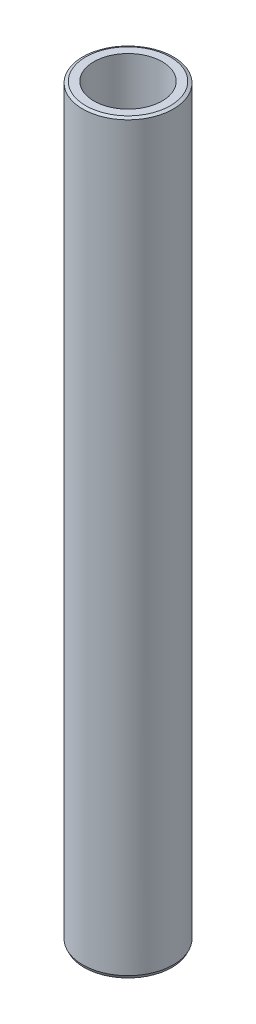
ISO-10303-21;
HEADER;
FILE_DESCRIPTION(('STEP AP214'),'2;1');
FILE_NAME('part.step','',(''),(''),'','','');
FILE_SCHEMA(('AUTOMOTIVE_DESIGN { 1 0 10303 214 1 1 1 1 }'));
ENDSEC;
DATA;
#1=APPLICATION_CONTEXT('core data for automotive mechanical design processes');
#2=APPLICATION_PROTOCOL_DEFINITION('international standard','automotive_design',2000,#1);
#3=PRODUCT_CONTEXT('',#1,'mechanical');
#4=PRODUCT('Part','Part','',(#3));
#5=PRODUCT_RELATED_PRODUCT_CATEGORY('part','',(#4));
#6=PRODUCT_DEFINITION_FORMATION('','',#4);
#7=PRODUCT_DEFINITION_CONTEXT('part definition',#1,'design');
#8=PRODUCT_DEFINITION('design','',#6,#7);
#9=PRODUCT_DEFINITION_SHAPE('','',#8);
#10=(LENGTH_UNIT() NAMED_UNIT(*) SI_UNIT(.MILLI.,.METRE.));
#11=(NAMED_UNIT(*) PLANE_ANGLE_UNIT() SI_UNIT($,.RADIAN.));
#12=(NAMED_UNIT(*) SI_UNIT($,.STERADIAN.) SOLID_ANGLE_UNIT());
#13=UNCERTAINTY_MEASURE_WITH_UNIT(LENGTH_MEASURE(1.E-05),#10,'distance_accuracy_value','');
#14=(GEOMETRIC_REPRESENTATION_CONTEXT(3) GLOBAL_UNCERTAINTY_ASSIGNED_CONTEXT((#13)) GLOBAL_UNIT_ASSIGNED_CONTEXT((#10,
#11,#12)) REPRESENTATION_CONTEXT('',''));
#15=CARTESIAN_POINT('',(0.,0.,0.));
#16=DIRECTION('',(0.,0.,1.));
#17=DIRECTION('',(1.,0.,0.));
#18=AXIS2_PLACEMENT_3D('',#15,#16,#17);
#19=CARTESIAN_POINT('',(0.,247.086293420265,0.));
#20=DIRECTION('',(0.,-1.,0.));
#21=DIRECTION('',(0.,0.,-1.));
#22=AXIS2_PLACEMENT_3D('',#19,#20,#21);
#23=CYLINDRICAL_SURFACE('',#22,15.);
#24=CARTESIAN_POINT('',(0.,246.631129493931,0.));
#25=DIRECTION('',(0.,1.,0.));
#26=DIRECTION('',(0.,0.,1.));
#27=AXIS2_PLACEMENT_3D('',#24,#25,#26);
#28=CIRCLE('',#27,15.);
#29=CARTESIAN_POINT('',(0.,246.631129493931,-15.));
#30=VERTEX_POINT('',#29);
#31=EDGE_CURVE('E50',#30,#30,#28,.F.);
#32=CARTESIAN_POINT('',(0.,0.98682713540299,0.));
#33=DIRECTION('',(0.,1.,0.));
#34=DIRECTION('',(0.,0.,1.));
#35=AXIS2_PLACEMENT_3D('',#32,#33,#34);
#36=CIRCLE('',#35,15.);
#37=CARTESIAN_POINT('',(0.,0.986827135402962,-15.));
#38=VERTEX_POINT('',#37);
#39=EDGE_CURVE('E51',#38,#38,#36,.T.);
#40=CARTESIAN_POINT('',(0.,246.631129493931,-15.));
#41=CARTESIAN_POINT('',(0.,244.072334677696,-15.));
#42=CARTESIAN_POINT('',(0.,241.513539861461,-15.));
#43=CARTESIAN_POINT('',(0.,236.395950228992,-15.));
#44=CARTESIAN_POINT('',(0.,233.837155412757,-15.));
#45=CARTESIAN_POINT('',(0.,228.719565780288,-15.));
#46=CARTESIAN_POINT('',(0.,226.160770964053,-15.));
#47=CARTESIAN_POINT('',(0.,221.043181331584,-15.));
#48=CARTESIAN_POINT('',(0.,218.484386515349,-15.));
#49=CARTESIAN_POINT('',(0.,213.36679688288,-15.));
#50=CARTESIAN_POINT('',(0.,210.808002066645,-15.));
#51=CARTESIAN_POINT('',(0.,205.690412434176,-15.));
#52=CARTESIAN_POINT('',(0.,203.131617617941,-15.));
#53=CARTESIAN_POINT('',(0.,198.014027985472,-15.));
#54=CARTESIAN_POINT('',(0.,195.455233169237,-15.));
#55=CARTESIAN_POINT('',(0.,190.337643536768,-15.));
#56=CARTESIAN_POINT('',(0.,187.778848720533,-15.));
#57=CARTESIAN_POINT('',(0.,182.661259088064,-15.));
#58=CARTESIAN_POINT('',(0.,180.102464271829,-15.));
#59=CARTESIAN_POINT('',(0.,174.98487463936,-15.));
#60=CARTESIAN_POINT('',(0.,172.426079823125,-15.));
#61=CARTESIAN_POINT('',(0.,167.308490190656,-15.));
#62=CARTESIAN_POINT('',(0.,164.749695374421,-15.));
#63=CARTESIAN_POINT('',(0.,159.632105741952,-15.));
#64=CARTESIAN_POINT('',(0.,157.073310925717,-15.));
#65=CARTESIAN_POINT('',(0.,151.955721293248,-15.));
#66=CARTESIAN_POINT('',(0.,149.396926477013,-15.));
#67=CARTESIAN_POINT('',(0.,144.279336844544,-15.));
#68=CARTESIAN_POINT('',(0.,141.720542028309,-15.));
#69=CARTESIAN_POINT('',(0.,136.60295239584,-15.));
#70=CARTESIAN_POINT('',(0.,134.044157579605,-15.));
#71=CARTESIAN_POINT('',(0.,128.926567947136,-15.));
#72=CARTESIAN_POINT('',(0.,126.367773130901,-15.));
#73=CARTESIAN_POINT('',(0.,121.250183498432,-15.));
#74=CARTESIAN_POINT('',(0.,118.691388682197,-15.));
#75=CARTESIAN_POINT('',(0.,113.573799049728,-15.));
#76=CARTESIAN_POINT('',(0.,111.015004233493,-15.));
#77=CARTESIAN_POINT('',(0.,105.897414601024,-15.));
#78=CARTESIAN_POINT('',(0.,103.33861978479,-15.));
#79=CARTESIAN_POINT('',(0.,98.2210301523202,-15.));
#80=CARTESIAN_POINT('',(0.,95.6622353360856,-15.));
#81=CARTESIAN_POINT('',(0.,90.5446457036162,-15.));
#82=CARTESIAN_POINT('',(0.,87.9858508873816,-15.));
#83=CARTESIAN_POINT('',(0.,82.8682612549122,-15.));
#84=CARTESIAN_POINT('',(0.,80.3094664386776,-15.));
#85=CARTESIAN_POINT('',(0.,75.1918768062082,-15.));
#86=CARTESIAN_POINT('',(0.,72.6330819899736,-15.));
#87=CARTESIAN_POINT('',(0.,67.5154923575042,-15.));
#88=CARTESIAN_POINT('',(0.,64.9566975412696,-15.));
#89=CARTESIAN_POINT('',(0.,59.8391079088002,-15.));
#90=CARTESIAN_POINT('',(0.,57.2803130925656,-15.));
#91=CARTESIAN_POINT('',(0.,52.1627234600962,-15.));
#92=CARTESIAN_POINT('',(0.,49.6039286438616,-15.));
#93=CARTESIAN_POINT('',(0.,44.4863390113923,-15.));
#94=CARTESIAN_POINT('',(0.,41.9275441951576,-15.));
#95=CARTESIAN_POINT('',(0.,36.8099545626883,-15.));
#96=CARTESIAN_POINT('',(0.,34.2511597464536,-15.));
#97=CARTESIAN_POINT('',(0.,29.1335701139843,-15.));
#98=CARTESIAN_POINT('',(0.,26.5747752977496,-15.));
#99=CARTESIAN_POINT('',(0.,21.4571856652803,-15.));
#100=CARTESIAN_POINT('',(0.,18.8983908490456,-15.));
#101=CARTESIAN_POINT('',(0.,13.7808012165763,-15.));
#102=CARTESIAN_POINT('',(0.,11.2220064003416,-15.));
#103=CARTESIAN_POINT('',(0.,6.1044167678723,-15.));
#104=CARTESIAN_POINT('',(0.,3.54562195163763,-15.));
#105=CARTESIAN_POINT('',(0.,0.986827135402962,-15.));
#106=B_SPLINE_CURVE_WITH_KNOTS('',3,(#40,#41,#42,#43,#44,#45,#46,#47,#48,#49,#50,#51,#52,#53,
#54,#55,#56,#57,#58,#59,#60,#61,#62,#63,#64,#65,#66,#67,#68,#69,#70,#71,#72,#73,#74,#75,#76,#77,
#78,#79,#80,#81,#82,#83,#84,#85,#86,#87,#88,#89,#90,#91,#92,#93,#94,#95,#96,#97,#98,#99,#100,
#101,#102,#103,#104,#105),.UNSPECIFIED.,.F.,.F.,(4,2,2,2,2,2,2,2,2,2,2,2,2,2,2,2,2,2,2,2,2,2,2,
2,2,2,2,2,2,2,2,2,4),(0.,7.676384448704,15.352768897408,23.029153346112,30.705537794816,
38.38192224352,46.058306692224,53.734691140928,61.4110755896319,69.0874600383359,
76.7638444870399,84.4402289357439,92.1166133844479,99.7929978331519,107.469382281856,
115.14576673056,122.822151179264,130.498535627968,138.174920076672,145.851304525376,
153.52768897408,161.204073422784,168.880457871488,176.556842320192,184.233226768896,
191.9096112176,199.585995666304,207.262380115008,214.938764563712,222.615149012416,
230.29153346112,237.967917909824,245.644302358528),.UNSPECIFIED.);
#107=EDGE_CURVE('BSEAM39',#30,#38,#106,.T.);
#108=ORIENTED_EDGE('',*,*,#31,.T.);
#109=ORIENTED_EDGE('',*,*,#39,.T.);
#110=ORIENTED_EDGE('',*,*,#107,.T.);
#111=ORIENTED_EDGE('',*,*,#107,.F.);
#112=EDGE_LOOP('',(#108,#110,#109,#111));
#113=FACE_BOUND('',#112,.T.);
#114=ADVANCED_FACE('F39',(#113),#23,.T.);
#115=CARTESIAN_POINT('',(0.,247.086293420265,0.));
#116=DIRECTION('',(0.,1.,0.));
#117=DIRECTION('',(0.,0.,1.));
#118=AXIS2_PLACEMENT_3D('',#115,#116,#117);
#119=PLANE('',#118);
#120=CARTESIAN_POINT('',(0.,247.086293420265,0.));
#121=DIRECTION('',(0.,1.,0.));
#122=DIRECTION('',(0.,0.,1.));
#123=AXIS2_PLACEMENT_3D('',#120,#121,#122);
#124=CIRCLE('',#123,14.0131728645976);
#125=CARTESIAN_POINT('',(0.,247.086293420265,14.0131728645976));
#126=VERTEX_POINT('',#125);
#127=EDGE_CURVE('E54',#126,#126,#124,.T.);
#128=ORIENTED_EDGE('',*,*,#127,.T.);
#129=EDGE_LOOP('',(#128));
#130=FACE_BOUND('',#129,.T.);
#131=CARTESIAN_POINT('',(0.,247.086293420265,0.));
#132=DIRECTION('',(0.,1.,0.));
#133=DIRECTION('',(0.,0.,1.));
#134=AXIS2_PLACEMENT_3D('',#131,#132,#133);
#135=CIRCLE('',#134,11.3056789227027);
#136=CARTESIAN_POINT('',(0.,247.086293420265,-11.3056789227027));
#137=VERTEX_POINT('',#136);
#138=EDGE_CURVE('E58',#137,#137,#135,.T.);
#139=ORIENTED_EDGE('',*,*,#138,.F.);
#140=EDGE_LOOP('',(#139));
#141=FACE_BOUND('',#140,.T.);
#142=ADVANCED_FACE('F69',(#130,#141),#119,.T.);
#143=CARTESIAN_POINT('',(0.,0.,0.));
#144=DIRECTION('',(0.,1.,0.));
#145=DIRECTION('',(0.,0.,1.));
#146=AXIS2_PLACEMENT_3D('',#143,#144,#145);
#147=PLANE('',#146);
#148=CARTESIAN_POINT('',(0.,0.,0.));
#149=DIRECTION('',(0.,1.,0.));
#150=DIRECTION('',(0.,0.,1.));
#151=AXIS2_PLACEMENT_3D('',#148,#149,#150);
#152=CIRCLE('',#151,14.5448360736657);
#153=CARTESIAN_POINT('',(0.,0.,14.5448360736657));
#154=VERTEX_POINT('',#153);
#155=EDGE_CURVE('E10',#154,#154,#152,.F.);
#156=ORIENTED_EDGE('',*,*,#155,.T.);
#157=EDGE_LOOP('',(#156));
#158=FACE_BOUND('',#157,.T.);
#159=CARTESIAN_POINT('',(0.,0.,0.));
#160=DIRECTION('',(0.,1.,0.));
#161=DIRECTION('',(0.,0.,1.));
#162=AXIS2_PLACEMENT_3D('',#159,#160,#161);
#163=CIRCLE('',#162,11.3056789227027);
#164=CARTESIAN_POINT('',(0.,0.,-11.3056789227027));
#165=VERTEX_POINT('',#164);
#166=EDGE_CURVE('E63',#165,#165,#163,.T.);
#167=ORIENTED_EDGE('',*,*,#166,.T.);
#168=EDGE_LOOP('',(#167));
#169=FACE_BOUND('',#168,.T.);
#170=ADVANCED_FACE('F75',(#158,#169),#147,.F.);
#171=CARTESIAN_POINT('',(0.,247.086293420265,0.));
#172=DIRECTION('',(0.,-1.,0.));
#173=DIRECTION('',(0.,0.,-1.));
#174=AXIS2_PLACEMENT_3D('',#171,#172,#173);
#175=CYLINDRICAL_SURFACE('',#174,11.3056789227027);
#176=CARTESIAN_POINT('',(0.,247.086293420265,-11.3056789227027));
#177=CARTESIAN_POINT('',(0.,244.512477863804,-11.3056789227027));
#178=CARTESIAN_POINT('',(0.,241.938662307342,-11.3056789227027));
#179=CARTESIAN_POINT('',(0.,236.79103119442,-11.3056789227027));
#180=CARTESIAN_POINT('',(0.,234.217215637959,-11.3056789227027));
#181=CARTESIAN_POINT('',(0.,229.069584525037,-11.3056789227027));
#182=CARTESIAN_POINT('',(0.,226.495768968576,-11.3056789227027));
#183=CARTESIAN_POINT('',(0.,221.348137855654,-11.3056789227027));
#184=CARTESIAN_POINT('',(0.,218.774322299193,-11.3056789227027));
#185=CARTESIAN_POINT('',(0.,213.626691186271,-11.3056789227027));
#186=CARTESIAN_POINT('',(0.,211.052875629809,-11.3056789227027));
#187=CARTESIAN_POINT('',(0.,205.905244516887,-11.3056789227027));
#188=CARTESIAN_POINT('',(0.,203.331428960426,-11.3056789227027));
#189=CARTESIAN_POINT('',(0.,198.183797847504,-11.3056789227027));
#190=CARTESIAN_POINT('',(0.,195.609982291043,-11.3056789227027));
#191=CARTESIAN_POINT('',(0.,190.462351178121,-11.3056789227027));
#192=CARTESIAN_POINT('',(0.,187.88853562166,-11.3056789227027));
#193=CARTESIAN_POINT('',(0.,182.740904508737,-11.3056789227027));
#194=CARTESIAN_POINT('',(0.,180.167088952276,-11.3056789227027));
#195=CARTESIAN_POINT('',(0.,175.019457839354,-11.3056789227027));
#196=CARTESIAN_POINT('',(0.,172.445642282893,-11.3056789227027));
#197=CARTESIAN_POINT('',(0.,167.298011169971,-11.3056789227027));
#198=CARTESIAN_POINT('',(0.,164.72419561351,-11.3056789227027));
#199=CARTESIAN_POINT('',(0.,159.576564500588,-11.3056789227027));
#200=CARTESIAN_POINT('',(0.,157.002748944127,-11.3056789227027));
#201=CARTESIAN_POINT('',(0.,151.855117831204,-11.3056789227027));
#202=CARTESIAN_POINT('',(0.,149.281302274743,-11.3056789227027));
#203=CARTESIAN_POINT('',(0.,144.133671161821,-11.3056789227027));
#204=CARTESIAN_POINT('',(0.,141.55985560536,-11.3056789227027));
#205=CARTESIAN_POINT('',(0.,136.412224492438,-11.3056789227027));
#206=CARTESIAN_POINT('',(0.,133.838408935977,-11.3056789227027));
#207=CARTESIAN_POINT('',(0.,128.690777823055,-11.3056789227027));
#208=CARTESIAN_POINT('',(0.,126.116962266593,-11.3056789227027));
#209=CARTESIAN_POINT('',(0.,120.969331153671,-11.3056789227027));
#210=CARTESIAN_POINT('',(0.,118.39551559721,-11.3056789227027));
#211=CARTESIAN_POINT('',(0.,113.247884484288,-11.3056789227027));
#212=CARTESIAN_POINT('',(0.,110.674068927827,-11.3056789227027));
#213=CARTESIAN_POINT('',(0.,105.526437814905,-11.3056789227027));
#214=CARTESIAN_POINT('',(0.,102.952622258444,-11.3056789227027));
#215=CARTESIAN_POINT('',(0.,97.8049911455214,-11.3056789227027));
#216=CARTESIAN_POINT('',(0.,95.2311755890603,-11.3056789227027));
#217=CARTESIAN_POINT('',(0.,90.0835444761382,-11.3056789227027));
#218=CARTESIAN_POINT('',(0.,87.5097289196771,-11.3056789227027));
#219=CARTESIAN_POINT('',(0.,82.3620978067549,-11.3056789227027));
#220=CARTESIAN_POINT('',(0.,79.7882822502938,-11.3056789227027));
#221=CARTESIAN_POINT('',(0.,74.6406511373716,-11.3056789227027));
#222=CARTESIAN_POINT('',(0.,72.0668355809105,-11.3056789227027));
#223=CARTESIAN_POINT('',(0.,66.9192044679883,-11.3056789227027));
#224=CARTESIAN_POINT('',(0.,64.3453889115273,-11.3056789227027));
#225=CARTESIAN_POINT('',(0.,59.1977577986051,-11.3056789227027));
#226=CARTESIAN_POINT('',(0.,56.623942242144,-11.3056789227027));
#227=CARTESIAN_POINT('',(0.,51.4763111292218,-11.3056789227027));
#228=CARTESIAN_POINT('',(0.,48.9024955727607,-11.3056789227027));
#229=CARTESIAN_POINT('',(0.,43.7548644598385,-11.3056789227027));
#230=CARTESIAN_POINT('',(0.,41.1810489033774,-11.3056789227027));
#231=CARTESIAN_POINT('',(0.,36.0334177904552,-11.3056789227027));
#232=CARTESIAN_POINT('',(0.,33.4596022339942,-11.3056789227027));
#233=CARTESIAN_POINT('',(0.,28.311971121072,-11.3056789227027));
#234=CARTESIAN_POINT('',(0.,25.7381555646109,-11.3056789227027));
#235=CARTESIAN_POINT('',(0.,20.5905244516887,-11.3056789227027));
#236=CARTESIAN_POINT('',(0.,18.0167088952276,-11.3056789227027));
#237=CARTESIAN_POINT('',(0.,12.8690777823054,-11.3056789227027));
#238=CARTESIAN_POINT('',(0.,10.2952622258443,-11.3056789227027));
#239=CARTESIAN_POINT('',(0.,5.14763111292215,-11.3056789227027));
#240=CARTESIAN_POINT('',(0.,2.57381555646106,-11.3056789227027));
#241=CARTESIAN_POINT('',(0.,0.,-11.3056789227027));
#242=B_SPLINE_CURVE_WITH_KNOTS('',3,(#176,#177,#178,#179,#180,#181,#182,#183,#184,#185,#186,
#187,#188,#189,#190,#191,#192,#193,#194,#195,#196,#197,#198,#199,#200,#201,#202,#203,#204,#205,
#206,#207,#208,#209,#210,#211,#212,#213,#214,#215,#216,#217,#218,#219,#220,#221,#222,#223,#224,
#225,#226,#227,#228,#229,#230,#231,#232,#233,#234,#235,#236,#237,#238,#239,#240,#241),
.UNSPECIFIED.,.F.,.F.,(4,2,2,2,2,2,2,2,2,2,2,2,2,2,2,2,2,2,2,2,2,2,2,2,2,2,2,2,2,2,2,2,4),(0.,
7.72144666938326,15.4428933387665,23.1643400081498,30.8857866775331,38.6072333469163,
46.3286800162996,54.0501266856829,61.7715733550662,69.4930200244494,77.2144666938327,
84.935913363216,92.6573600325993,100.378806701983,108.100253371366,115.821700040749,
123.543146710132,131.264593379516,138.986040048899,146.707486718282,154.428933387665,
162.150380057049,169.871826726432,177.593273395815,185.314720065199,193.036166734582,
200.757613403965,208.479060073348,216.200506742732,223.921953412115,231.643400081498,
239.364846750881,247.086293420265),.UNSPECIFIED.);
#243=EDGE_CURVE('BSEAM70',#137,#165,#242,.T.);
#244=ORIENTED_EDGE('',*,*,#138,.T.);
#245=ORIENTED_EDGE('',*,*,#166,.F.);
#246=ORIENTED_EDGE('',*,*,#243,.T.);
#247=ORIENTED_EDGE('',*,*,#243,.F.);
#248=EDGE_LOOP('',(#244,#246,#245,#247));
#249=FACE_BOUND('',#248,.T.);
#250=ADVANCED_FACE('F70',(#249),#175,.F.);
#251=CARTESIAN_POINT('',(0.,247.086293420265,0.));
#252=DIRECTION('',(0.,-1.,0.));
#253=DIRECTION('',(0.,0.,-1.));
#254=AXIS2_PLACEMENT_3D('',#251,#252,#253);
#255=CONICAL_SURFACE('',#254,14.0131728645976,1.13863481310928);
#256=ORIENTED_EDGE('',*,*,#31,.F.);
#257=EDGE_LOOP('',(#256));
#258=FACE_BOUND('',#257,.T.);
#259=ORIENTED_EDGE('',*,*,#127,.F.);
#260=EDGE_LOOP('',(#259));
#261=FACE_BOUND('',#260,.T.);
#262=ADVANCED_FACE('F81',(#258,#261),#255,.T.);
#263=CARTESIAN_POINT('',(0.,0.98682713540299,0.));
#264=DIRECTION('',(0.,1.,0.));
#265=DIRECTION('',(0.,0.,1.));
#266=AXIS2_PLACEMENT_3D('',#263,#264,#265);
#267=CONICAL_SURFACE('',#266,15.,0.432161513685628);
#268=ORIENTED_EDGE('',*,*,#155,.F.);
#269=EDGE_LOOP('',(#268));
#270=FACE_BOUND('',#269,.T.);
#271=ORIENTED_EDGE('',*,*,#39,.F.);
#272=EDGE_LOOP('',(#271));
#273=FACE_BOUND('',#272,.T.);
#274=ADVANCED_FACE('F45',(#270,#273),#267,.T.);
#275=CLOSED_SHELL('',(#114,#142,#170,#250,#262,#274));
#276=MANIFOLD_SOLID_BREP('B2',#275);
#277=ADVANCED_BREP_SHAPE_REPRESENTATION('',(#18,#276),#14);
#278=SHAPE_DEFINITION_REPRESENTATION(#9,#277);
ENDSEC;
END-ISO-10303-21;
